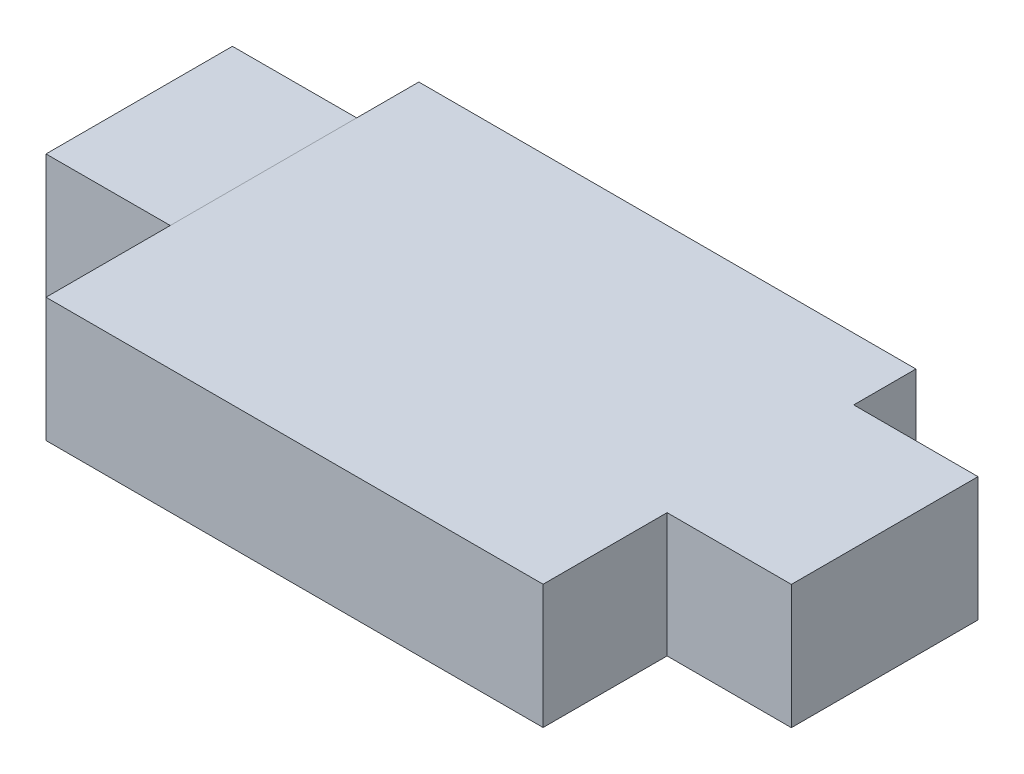
ISO-10303-21;
HEADER;
FILE_DESCRIPTION(('STEP AP214'),'2;1');
FILE_NAME('part.step','',(''),(''),'','','');
FILE_SCHEMA(('AUTOMOTIVE_DESIGN { 1 0 10303 214 1 1 1 1 }'));
ENDSEC;
DATA;
#1=APPLICATION_CONTEXT('core data for automotive mechanical design processes');
#2=APPLICATION_PROTOCOL_DEFINITION('international standard','automotive_design',2000,#1);
#3=PRODUCT_CONTEXT('',#1,'mechanical');
#4=PRODUCT('Part','Part','',(#3));
#5=PRODUCT_RELATED_PRODUCT_CATEGORY('part','',(#4));
#6=PRODUCT_DEFINITION_FORMATION('','',#4);
#7=PRODUCT_DEFINITION_CONTEXT('part definition',#1,'design');
#8=PRODUCT_DEFINITION('design','',#6,#7);
#9=PRODUCT_DEFINITION_SHAPE('','',#8);
#10=(LENGTH_UNIT() NAMED_UNIT(*) SI_UNIT(.MILLI.,.METRE.));
#11=(NAMED_UNIT(*) PLANE_ANGLE_UNIT() SI_UNIT($,.RADIAN.));
#12=(NAMED_UNIT(*) SI_UNIT($,.STERADIAN.) SOLID_ANGLE_UNIT());
#13=UNCERTAINTY_MEASURE_WITH_UNIT(LENGTH_MEASURE(1.E-05),#10,'distance_accuracy_value','');
#14=(GEOMETRIC_REPRESENTATION_CONTEXT(3) GLOBAL_UNCERTAINTY_ASSIGNED_CONTEXT((#13)) GLOBAL_UNIT_ASSIGNED_CONTEXT((#10,
#11,#12)) REPRESENTATION_CONTEXT('',''));
#15=CARTESIAN_POINT('',(0.,0.,0.));
#16=DIRECTION('',(0.,0.,1.));
#17=DIRECTION('',(1.,0.,0.));
#18=AXIS2_PLACEMENT_3D('',#15,#16,#17);
#19=CARTESIAN_POINT('',(-7.99761984167355,-199.086972688435,-6.));
#20=DIRECTION('',(0.999999289997347,0.00119163954387629,0.));
#21=DIRECTION('',(-0.00119163954387629,0.999999289997347,0.));
#22=AXIS2_PLACEMENT_3D('',#19,#20,#21);
#23=PLANE('',#22);
#24=DIRECTION('',(-0.00119163954387628,0.999999289997347,0.));
#25=VECTOR('',#24,1.);
#26=CARTESIAN_POINT('',(-7.99761984167355,-199.086972688435,-1.99975190593449));
#27=LINE('',#26,#25);
#28=CARTESIAN_POINT('',(-7.99761984167355,-199.086972688435,-1.99975190593449));
#29=VERTEX_POINT('',#28);
#30=CARTESIAN_POINT('',(-8.00000000000018,-197.089592986715,-1.99975190593449));
#31=VERTEX_POINT('',#30);
#32=EDGE_CURVE('E48',#29,#31,#27,.T.);
#33=ORIENTED_EDGE('',*,*,#32,.F.);
#34=DIRECTION('',(0.,0.,1.));
#35=VECTOR('',#34,1.);
#36=CARTESIAN_POINT('',(-7.99761984167355,-199.086972688435,-6.));
#37=LINE('',#36,#35);
#38=CARTESIAN_POINT('',(-7.99761984167355,-199.086972688435,0.));
#39=VERTEX_POINT('',#38);
#40=EDGE_CURVE('E188',#29,#39,#37,.T.);
#41=ORIENTED_EDGE('',*,*,#40,.T.);
#42=DIRECTION('',(-0.00119163954387629,0.999999289997347,0.));
#43=VECTOR('',#42,1.);
#44=CARTESIAN_POINT('',(-7.99761984167355,-199.086972688435,0.));
#45=LINE('',#44,#43);
#46=CARTESIAN_POINT('',(-8.00000000000018,-197.089592986715,0.));
#47=VERTEX_POINT('',#46);
#48=EDGE_CURVE('E175',#39,#47,#45,.T.);
#49=ORIENTED_EDGE('',*,*,#48,.T.);
#50=DIRECTION('',(0.,0.,1.));
#51=VECTOR('',#50,1.);
#52=CARTESIAN_POINT('',(-8.00000000000018,-197.089592986715,-6.));
#53=LINE('',#52,#51);
#54=EDGE_CURVE('E41',#31,#47,#53,.T.);
#55=ORIENTED_EDGE('',*,*,#54,.F.);
#56=EDGE_LOOP('',(#33,#41,#49,#55));
#57=FACE_BOUND('',#56,.T.);
#58=ADVANCED_FACE('F34',(#57),#23,.F.);
#59=DIRECTION('',(0.00119163954387628,-0.999999289997347,0.));
#60=VECTOR('',#59,1.);
#61=CARTESIAN_POINT('',(-7.99761984167355,-199.086972688435,-5.00004271554388));
#62=LINE('',#61,#60);
#63=CARTESIAN_POINT('',(-8.00000000000018,-197.089592986715,-5.00004271554388));
#64=VERTEX_POINT('',#63);
#65=CARTESIAN_POINT('',(-7.99761984167355,-199.086972688435,-5.00004271554388));
#66=VERTEX_POINT('',#65);
#67=EDGE_CURVE('E244',#64,#66,#62,.T.);
#68=ORIENTED_EDGE('',*,*,#67,.F.);
#69=CARTESIAN_POINT('',(-8.00000000000018,-197.089592986715,-6.));
#70=VERTEX_POINT('',#69);
#71=EDGE_CURVE('E11',#70,#64,#53,.T.);
#72=ORIENTED_EDGE('',*,*,#71,.F.);
#73=DIRECTION('',(-0.00119163954387629,0.999999289997347,0.));
#74=VECTOR('',#73,1.);
#75=CARTESIAN_POINT('',(-7.99761984167355,-199.086972688435,-6.));
#76=LINE('',#75,#74);
#77=CARTESIAN_POINT('',(-7.99761984167355,-199.086972688435,-6.));
#78=VERTEX_POINT('',#77);
#79=EDGE_CURVE('E176',#78,#70,#76,.T.);
#80=ORIENTED_EDGE('',*,*,#79,.F.);
#81=EDGE_CURVE('E198',#78,#66,#37,.T.);
#82=ORIENTED_EDGE('',*,*,#81,.T.);
#83=EDGE_LOOP('',(#68,#72,#80,#82));
#84=FACE_BOUND('',#83,.T.);
#85=ADVANCED_FACE('F269',(#84),#23,.F.);
#86=CARTESIAN_POINT('',(0.,-199.086972688435,-6.));
#87=DIRECTION('',(1.,0.,0.));
#88=DIRECTION('',(0.,1.,0.));
#89=AXIS2_PLACEMENT_3D('',#86,#87,#88);
#90=PLANE('',#89);
#91=DIRECTION('',(0.,-1.,0.));
#92=VECTOR('',#91,1.);
#93=CARTESIAN_POINT('',(-5.92845346300285E-12,-199.086972688435,-1.99547837634384));
#94=LINE('',#93,#92);
#95=CARTESIAN_POINT('',(0.,-197.089592986714,-1.99547837634384));
#96=VERTEX_POINT('',#95);
#97=CARTESIAN_POINT('',(0.,-199.086972688435,-1.99547837634384));
#98=VERTEX_POINT('',#97);
#99=EDGE_CURVE('E143',#96,#98,#94,.T.);
#100=ORIENTED_EDGE('',*,*,#99,.F.);
#101=DIRECTION('',(0.,0.,1.));
#102=VECTOR('',#101,1.);
#103=CARTESIAN_POINT('',(0.,-197.089592986714,-6.));
#104=LINE('',#103,#102);
#105=CARTESIAN_POINT('',(0.,-197.089592986714,0.));
#106=VERTEX_POINT('',#105);
#107=EDGE_CURVE('E203',#96,#106,#104,.T.);
#108=ORIENTED_EDGE('',*,*,#107,.T.);
#109=DIRECTION('',(0.,1.,0.));
#110=VECTOR('',#109,1.);
#111=CARTESIAN_POINT('',(0.,-199.086972688435,0.));
#112=LINE('',#111,#110);
#113=CARTESIAN_POINT('',(0.,-199.086972688435,0.));
#114=VERTEX_POINT('',#113);
#115=EDGE_CURVE('E193',#114,#106,#112,.T.);
#116=ORIENTED_EDGE('',*,*,#115,.F.);
#117=DIRECTION('',(0.,0.,1.));
#118=VECTOR('',#117,1.);
#119=CARTESIAN_POINT('',(0.,-199.086972688435,-6.));
#120=LINE('',#119,#118);
#121=EDGE_CURVE('E200',#98,#114,#120,.T.);
#122=ORIENTED_EDGE('',*,*,#121,.F.);
#123=EDGE_LOOP('',(#100,#108,#116,#122));
#124=FACE_BOUND('',#123,.T.);
#125=ADVANCED_FACE('F210',(#124),#90,.T.);
#126=CARTESIAN_POINT('',(0.,-197.089592986714,-6.));
#127=DIRECTION('',(0.,1.,0.));
#128=DIRECTION('',(-1.,0.,0.));
#129=AXIS2_PLACEMENT_3D('',#126,#127,#128);
#130=PLANE('',#129);
#131=DIRECTION('',(-1.,0.,0.));
#132=VECTOR('',#131,1.);
#133=CARTESIAN_POINT('',(0.,-197.089592986714,0.));
#134=LINE('',#133,#132);
#135=EDGE_CURVE('E190',#106,#47,#134,.T.);
#136=ORIENTED_EDGE('',*,*,#135,.F.);
#137=ORIENTED_EDGE('',*,*,#107,.F.);
#138=DIRECTION('',(-1.,0.,0.));
#139=VECTOR('',#138,1.);
#140=CARTESIAN_POINT('',(1.99999999999413,-197.089592986715,-1.99547837634384));
#141=LINE('',#140,#139);
#142=CARTESIAN_POINT('',(1.99999999999413,-197.089592986715,-1.99547837634384));
#143=VERTEX_POINT('',#142);
#144=EDGE_CURVE('E160',#143,#96,#141,.T.);
#145=ORIENTED_EDGE('',*,*,#144,.F.);
#146=DIRECTION('',(0.,0.,1.));
#147=VECTOR('',#146,1.);
#148=CARTESIAN_POINT('',(1.99999999999413,-197.089592986715,-1.99547837634384));
#149=LINE('',#148,#147);
#150=CARTESIAN_POINT('',(1.99999999999413,-197.089592986715,-4.99914760428055));
#151=VERTEX_POINT('',#150);
#152=EDGE_CURVE('E159',#151,#143,#149,.T.);
#153=ORIENTED_EDGE('',*,*,#152,.F.);
#154=DIRECTION('',(-1.,0.,0.));
#155=VECTOR('',#154,1.);
#156=CARTESIAN_POINT('',(1.99999999999413,-197.089592986715,-4.99914760428055));
#157=LINE('',#156,#155);
#158=CARTESIAN_POINT('',(-5.86897507298219E-12,-197.089592986714,-4.99914760428055));
#159=VERTEX_POINT('',#158);
#160=EDGE_CURVE('E166',#151,#159,#157,.T.);
#161=ORIENTED_EDGE('',*,*,#160,.T.);
#162=CARTESIAN_POINT('',(0.,-197.089592986714,-6.));
#163=VERTEX_POINT('',#162);
#164=EDGE_CURVE('E204',#163,#159,#104,.T.);
#165=ORIENTED_EDGE('',*,*,#164,.F.);
#166=DIRECTION('',(-1.,0.,0.));
#167=VECTOR('',#166,1.);
#168=CARTESIAN_POINT('',(0.,-197.089592986714,-6.));
#169=LINE('',#168,#167);
#170=EDGE_CURVE('E178',#163,#70,#169,.T.);
#171=ORIENTED_EDGE('',*,*,#170,.T.);
#172=ORIENTED_EDGE('',*,*,#71,.T.);
#173=DIRECTION('',(0.,0.,-1.));
#174=VECTOR('',#173,1.);
#175=CARTESIAN_POINT('',(-8.00000000000018,-197.089592986714,-1.99975190593449));
#176=LINE('',#175,#174);
#177=EDGE_CURVE('E242',#31,#64,#176,.T.);
#178=ORIENTED_EDGE('',*,*,#177,.F.);
#179=ORIENTED_EDGE('',*,*,#54,.T.);
#180=EDGE_LOOP('',(#136,#137,#145,#153,#161,#165,#171,#172,#178,#179));
#181=FACE_BOUND('',#180,.T.);
#182=ADVANCED_FACE('F213',(#181),#130,.T.);
#183=DIRECTION('',(0.,1.,0.));
#184=VECTOR('',#183,1.);
#185=CARTESIAN_POINT('',(-5.92845346300285E-12,-199.086972688435,-4.99914760428055));
#186=LINE('',#185,#184);
#187=CARTESIAN_POINT('',(0.,-199.086972688435,-4.99914760428055));
#188=VERTEX_POINT('',#187);
#189=EDGE_CURVE('E146',#188,#159,#186,.T.);
#190=ORIENTED_EDGE('',*,*,#189,.F.);
#191=CARTESIAN_POINT('',(0.,-199.086972688435,-6.));
#192=VERTEX_POINT('',#191);
#193=EDGE_CURVE('E201',#192,#188,#120,.T.);
#194=ORIENTED_EDGE('',*,*,#193,.F.);
#195=DIRECTION('',(0.,1.,0.));
#196=VECTOR('',#195,1.);
#197=CARTESIAN_POINT('',(0.,-199.086972688435,-6.));
#198=LINE('',#197,#196);
#199=EDGE_CURVE('E182',#192,#163,#198,.T.);
#200=ORIENTED_EDGE('',*,*,#199,.T.);
#201=ORIENTED_EDGE('',*,*,#164,.T.);
#202=EDGE_LOOP('',(#190,#194,#200,#201));
#203=FACE_BOUND('',#202,.T.);
#204=ADVANCED_FACE('F234',(#203),#90,.T.);
#205=CARTESIAN_POINT('',(-7.99761984167355,-199.086972688435,-6.));
#206=DIRECTION('',(0.,-1.,0.));
#207=DIRECTION('',(1.,0.,0.));
#208=AXIS2_PLACEMENT_3D('',#205,#206,#207);
#209=PLANE('',#208);
#210=DIRECTION('',(1.,0.,0.));
#211=VECTOR('',#210,1.);
#212=CARTESIAN_POINT('',(-7.99761984167355,-199.086972688435,0.));
#213=LINE('',#212,#211);
#214=EDGE_CURVE('E179',#39,#114,#213,.T.);
#215=ORIENTED_EDGE('',*,*,#214,.F.);
#216=ORIENTED_EDGE('',*,*,#40,.F.);
#217=DIRECTION('',(0.,0.,1.));
#218=VECTOR('',#217,1.);
#219=CARTESIAN_POINT('',(-7.99761984167355,-199.086972688435,-1.99975190593449));
#220=LINE('',#219,#218);
#221=EDGE_CURVE('E140',#66,#29,#220,.T.);
#222=ORIENTED_EDGE('',*,*,#221,.F.);
#223=ORIENTED_EDGE('',*,*,#81,.F.);
#224=DIRECTION('',(1.,0.,0.));
#225=VECTOR('',#224,1.);
#226=CARTESIAN_POINT('',(-7.99761984167355,-199.086972688435,-6.));
#227=LINE('',#226,#225);
#228=EDGE_CURVE('E185',#78,#192,#227,.T.);
#229=ORIENTED_EDGE('',*,*,#228,.T.);
#230=ORIENTED_EDGE('',*,*,#193,.T.);
#231=DIRECTION('',(-1.,0.,0.));
#232=VECTOR('',#231,1.);
#233=CARTESIAN_POINT('',(1.99999999999407,-199.086972688435,-4.99914760428055));
#234=LINE('',#233,#232);
#235=CARTESIAN_POINT('',(1.99999999999407,-199.086972688435,-4.99914760428055));
#236=VERTEX_POINT('',#235);
#237=EDGE_CURVE('E169',#236,#188,#234,.T.);
#238=ORIENTED_EDGE('',*,*,#237,.F.);
#239=DIRECTION('',(0.,0.,-1.));
#240=VECTOR('',#239,1.);
#241=CARTESIAN_POINT('',(1.99999999999407,-199.086972688435,-1.99547837634384));
#242=LINE('',#241,#240);
#243=CARTESIAN_POINT('',(1.99999999999407,-199.086972688435,-1.99547837634384));
#244=VERTEX_POINT('',#243);
#245=EDGE_CURVE('E155',#244,#236,#242,.T.);
#246=ORIENTED_EDGE('',*,*,#245,.F.);
#247=DIRECTION('',(-1.,0.,0.));
#248=VECTOR('',#247,1.);
#249=CARTESIAN_POINT('',(1.99999999999407,-199.086972688435,-1.99547837634384));
#250=LINE('',#249,#248);
#251=EDGE_CURVE('E172',#244,#98,#250,.T.);
#252=ORIENTED_EDGE('',*,*,#251,.T.);
#253=ORIENTED_EDGE('',*,*,#121,.T.);
#254=EDGE_LOOP('',(#215,#216,#222,#223,#229,#230,#238,#246,#252,#253));
#255=FACE_BOUND('',#254,.T.);
#256=ADVANCED_FACE('F219',(#255),#209,.T.);
#257=CARTESIAN_POINT('',(0.,0.,-6.));
#258=DIRECTION('',(0.,0.,1.));
#259=DIRECTION('',(1.,0.,0.));
#260=AXIS2_PLACEMENT_3D('',#257,#258,#259);
#261=PLANE('',#260);
#262=ORIENTED_EDGE('',*,*,#79,.T.);
#263=ORIENTED_EDGE('',*,*,#170,.F.);
#264=ORIENTED_EDGE('',*,*,#199,.F.);
#265=ORIENTED_EDGE('',*,*,#228,.F.);
#266=EDGE_LOOP('',(#262,#263,#264,#265));
#267=FACE_BOUND('',#266,.T.);
#268=ADVANCED_FACE('F239',(#267),#261,.F.);
#269=CARTESIAN_POINT('',(0.,0.,0.));
#270=DIRECTION('',(0.,0.,1.));
#271=DIRECTION('',(1.,0.,0.));
#272=AXIS2_PLACEMENT_3D('',#269,#270,#271);
#273=PLANE('',#272);
#274=ORIENTED_EDGE('',*,*,#48,.F.);
#275=ORIENTED_EDGE('',*,*,#214,.T.);
#276=ORIENTED_EDGE('',*,*,#115,.T.);
#277=ORIENTED_EDGE('',*,*,#135,.T.);
#278=EDGE_LOOP('',(#274,#275,#276,#277));
#279=FACE_BOUND('',#278,.T.);
#280=ADVANCED_FACE('F216',(#279),#273,.T.);
#281=CARTESIAN_POINT('',(1.99999999999407,-199.086972688435,-1.99547837634384));
#282=DIRECTION('',(0.,0.,-1.));
#283=DIRECTION('',(-1.,0.,0.));
#284=AXIS2_PLACEMENT_3D('',#281,#282,#283);
#285=PLANE('',#284);
#286=ORIENTED_EDGE('',*,*,#99,.T.);
#287=ORIENTED_EDGE('',*,*,#251,.F.);
#288=DIRECTION('',(0.,-1.,0.));
#289=VECTOR('',#288,1.);
#290=CARTESIAN_POINT('',(1.99999999999407,-199.086972688435,-1.99547837634384));
#291=LINE('',#290,#289);
#292=EDGE_CURVE('E152',#143,#244,#291,.T.);
#293=ORIENTED_EDGE('',*,*,#292,.F.);
#294=ORIENTED_EDGE('',*,*,#144,.T.);
#295=EDGE_LOOP('',(#286,#287,#293,#294));
#296=FACE_BOUND('',#295,.T.);
#297=ADVANCED_FACE('F226',(#296),#285,.F.);
#298=CARTESIAN_POINT('',(1.99999999999407,-199.086972688435,-4.99914760428055));
#299=DIRECTION('',(0.,0.,1.));
#300=DIRECTION('',(1.,0.,0.));
#301=AXIS2_PLACEMENT_3D('',#298,#299,#300);
#302=PLANE('',#301);
#303=ORIENTED_EDGE('',*,*,#189,.T.);
#304=ORIENTED_EDGE('',*,*,#160,.F.);
#305=DIRECTION('',(0.,1.,0.));
#306=VECTOR('',#305,1.);
#307=CARTESIAN_POINT('',(1.99999999999407,-199.086972688435,-4.99914760428055));
#308=LINE('',#307,#306);
#309=EDGE_CURVE('E157',#236,#151,#308,.T.);
#310=ORIENTED_EDGE('',*,*,#309,.F.);
#311=ORIENTED_EDGE('',*,*,#237,.T.);
#312=EDGE_LOOP('',(#303,#304,#310,#311));
#313=FACE_BOUND('',#312,.T.);
#314=ADVANCED_FACE('F233',(#313),#302,.F.);
#315=CARTESIAN_POINT('',(2.,0.,0.));
#316=DIRECTION('',(-1.,0.,0.));
#317=DIRECTION('',(0.,-1.,0.));
#318=AXIS2_PLACEMENT_3D('',#315,#316,#317);
#319=PLANE('',#318);
#320=ORIENTED_EDGE('',*,*,#292,.T.);
#321=ORIENTED_EDGE('',*,*,#245,.T.);
#322=ORIENTED_EDGE('',*,*,#309,.T.);
#323=ORIENTED_EDGE('',*,*,#152,.T.);
#324=EDGE_LOOP('',(#320,#321,#322,#323));
#325=FACE_BOUND('',#324,.T.);
#326=ADVANCED_FACE('F230',(#325),#319,.F.);
#327=CARTESIAN_POINT('',(-9.99761842166824,-199.089355967522,-1.99975190593449));
#328=DIRECTION('',(0.,0.,-1.));
#329=DIRECTION('',(-1.,0.,0.));
#330=AXIS2_PLACEMENT_3D('',#327,#328,#329);
#331=PLANE('',#330);
#332=ORIENTED_EDGE('',*,*,#32,.T.);
#333=DIRECTION('',(0.999999289997347,0.00119163954387629,0.));
#334=VECTOR('',#333,1.);
#335=CARTESIAN_POINT('',(-9.99999857999487,-197.091976265802,-1.99975190593449));
#336=LINE('',#335,#334);
#337=CARTESIAN_POINT('',(-9.99999857999487,-197.091976265802,-1.99975190593449));
#338=VERTEX_POINT('',#337);
#339=EDGE_CURVE('E125',#338,#31,#336,.T.);
#340=ORIENTED_EDGE('',*,*,#339,.F.);
#341=DIRECTION('',(-0.00119163954387628,0.999999289997347,0.));
#342=VECTOR('',#341,1.);
#343=CARTESIAN_POINT('',(-9.99761842166824,-199.089355967522,-1.99975190593449));
#344=LINE('',#343,#342);
#345=CARTESIAN_POINT('',(-9.99761842166824,-199.089355967522,-1.99975190593449));
#346=VERTEX_POINT('',#345);
#347=EDGE_CURVE('E131',#346,#338,#344,.T.);
#348=ORIENTED_EDGE('',*,*,#347,.F.);
#349=DIRECTION('',(0.999999289997347,0.00119163954387629,0.));
#350=VECTOR('',#349,1.);
#351=CARTESIAN_POINT('',(-9.99761842166824,-199.089355967522,-1.99975190593449));
#352=LINE('',#351,#350);
#353=EDGE_CURVE('E252',#346,#29,#352,.T.);
#354=ORIENTED_EDGE('',*,*,#353,.T.);
#355=EDGE_LOOP('',(#332,#340,#348,#354));
#356=FACE_BOUND('',#355,.T.);
#357=ADVANCED_FACE('F142',(#356),#331,.F.);
#358=CARTESIAN_POINT('',(-9.99999857999487,-197.091976265802,-1.99975190593449));
#359=DIRECTION('',(0.00119163954387629,-0.999999289997347,0.));
#360=DIRECTION('',(0.999999289997347,0.00119163954387629,0.));
#361=AXIS2_PLACEMENT_3D('',#358,#359,#360);
#362=PLANE('',#361);
#363=ORIENTED_EDGE('',*,*,#177,.T.);
#364=DIRECTION('',(0.999999289997347,0.00119163954387629,0.));
#365=VECTOR('',#364,1.);
#366=CARTESIAN_POINT('',(-9.99999857999487,-197.091976265802,-5.00004271554388));
#367=LINE('',#366,#365);
#368=CARTESIAN_POINT('',(-9.99999857999487,-197.091976265802,-5.00004271554388));
#369=VERTEX_POINT('',#368);
#370=EDGE_CURVE('E127',#369,#64,#367,.T.);
#371=ORIENTED_EDGE('',*,*,#370,.F.);
#372=DIRECTION('',(0.,0.,-1.));
#373=VECTOR('',#372,1.);
#374=CARTESIAN_POINT('',(-9.99999857999487,-197.091976265802,-1.99975190593449));
#375=LINE('',#374,#373);
#376=EDGE_CURVE('E120',#338,#369,#375,.T.);
#377=ORIENTED_EDGE('',*,*,#376,.F.);
#378=ORIENTED_EDGE('',*,*,#339,.T.);
#379=EDGE_LOOP('',(#363,#371,#377,#378));
#380=FACE_BOUND('',#379,.T.);
#381=ADVANCED_FACE('F123',(#380),#362,.F.);
#382=CARTESIAN_POINT('',(-9.99761842166824,-199.089355967522,-5.00004271554388));
#383=DIRECTION('',(0.,0.,1.));
#384=DIRECTION('',(1.,0.,0.));
#385=AXIS2_PLACEMENT_3D('',#382,#383,#384);
#386=PLANE('',#385);
#387=ORIENTED_EDGE('',*,*,#67,.T.);
#388=DIRECTION('',(0.999999289997347,0.00119163954387629,0.));
#389=VECTOR('',#388,1.);
#390=CARTESIAN_POINT('',(-9.99761842166824,-199.089355967522,-5.00004271554388));
#391=LINE('',#390,#389);
#392=CARTESIAN_POINT('',(-9.99761842166824,-199.089355967522,-5.00004271554388));
#393=VERTEX_POINT('',#392);
#394=EDGE_CURVE('E148',#393,#66,#391,.T.);
#395=ORIENTED_EDGE('',*,*,#394,.F.);
#396=DIRECTION('',(0.00119163954387628,-0.999999289997347,0.));
#397=VECTOR('',#396,1.);
#398=CARTESIAN_POINT('',(-9.99761842166824,-199.089355967522,-5.00004271554388));
#399=LINE('',#398,#397);
#400=EDGE_CURVE('E130',#369,#393,#399,.T.);
#401=ORIENTED_EDGE('',*,*,#400,.F.);
#402=ORIENTED_EDGE('',*,*,#370,.T.);
#403=EDGE_LOOP('',(#387,#395,#401,#402));
#404=FACE_BOUND('',#403,.T.);
#405=ADVANCED_FACE('F248',(#404),#386,.F.);
#406=CARTESIAN_POINT('',(-9.99761842166824,-199.089355967522,-1.99975190593449));
#407=DIRECTION('',(-0.00119163954387629,0.999999289997347,0.));
#408=DIRECTION('',(-0.999999289997347,-0.00119163954387629,0.));
#409=AXIS2_PLACEMENT_3D('',#406,#407,#408);
#410=PLANE('',#409);
#411=ORIENTED_EDGE('',*,*,#221,.T.);
#412=ORIENTED_EDGE('',*,*,#353,.F.);
#413=DIRECTION('',(0.,0.,1.));
#414=VECTOR('',#413,1.);
#415=CARTESIAN_POINT('',(-9.99761842166824,-199.089355967522,-1.99975190593449));
#416=LINE('',#415,#414);
#417=EDGE_CURVE('E136',#393,#346,#416,.T.);
#418=ORIENTED_EDGE('',*,*,#417,.F.);
#419=ORIENTED_EDGE('',*,*,#394,.T.);
#420=EDGE_LOOP('',(#411,#412,#418,#419));
#421=FACE_BOUND('',#420,.T.);
#422=ADVANCED_FACE('F259',(#421),#410,.F.);
#423=CARTESIAN_POINT('',(-10.2348468058949,-0.0121962568387948,0.));
#424=DIRECTION('',(-0.999999289997347,-0.00119163954387628,0.));
#425=DIRECTION('',(0.00119163954387628,-0.999999289997347,0.));
#426=AXIS2_PLACEMENT_3D('',#423,#424,#425);
#427=PLANE('',#426);
#428=ORIENTED_EDGE('',*,*,#347,.T.);
#429=ORIENTED_EDGE('',*,*,#376,.T.);
#430=ORIENTED_EDGE('',*,*,#400,.T.);
#431=ORIENTED_EDGE('',*,*,#417,.T.);
#432=EDGE_LOOP('',(#428,#429,#430,#431));
#433=FACE_BOUND('',#432,.T.);
#434=ADVANCED_FACE('F134',(#433),#427,.T.);
#435=CLOSED_SHELL('',(#58,#85,#125,#182,#204,#256,#268,#280,#297,#314,#326,#357,#381,#405,#422,#434));
#436=MANIFOLD_SOLID_BREP('B2',#435);
#437=ADVANCED_BREP_SHAPE_REPRESENTATION('',(#18,#436),#14);
#438=SHAPE_DEFINITION_REPRESENTATION(#9,#437);
ENDSEC;
END-ISO-10303-21;
